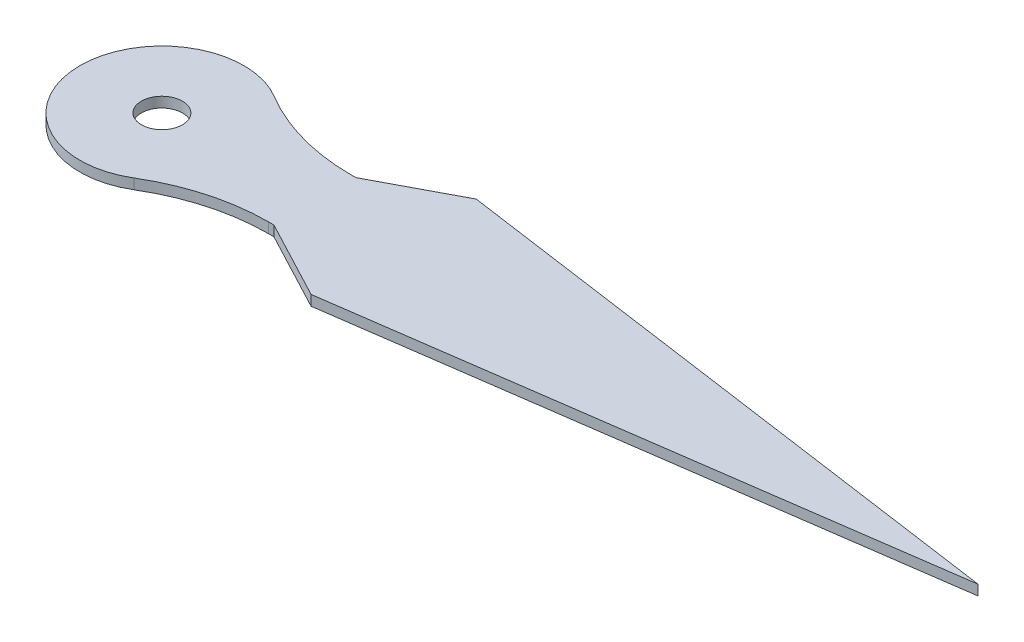
ISO-10303-21;
HEADER;
FILE_DESCRIPTION(('STEP AP214'),'2;1');
FILE_NAME('part.step','',(''),(''),'','','');
FILE_SCHEMA(('AUTOMOTIVE_DESIGN { 1 0 10303 214 1 1 1 1 }'));
ENDSEC;
DATA;
#1=APPLICATION_CONTEXT('core data for automotive mechanical design processes');
#2=APPLICATION_PROTOCOL_DEFINITION('international standard','automotive_design',2000,#1);
#3=PRODUCT_CONTEXT('',#1,'mechanical');
#4=PRODUCT('Part','Part','',(#3));
#5=PRODUCT_RELATED_PRODUCT_CATEGORY('part','',(#4));
#6=PRODUCT_DEFINITION_FORMATION('','',#4);
#7=PRODUCT_DEFINITION_CONTEXT('part definition',#1,'design');
#8=PRODUCT_DEFINITION('design','',#6,#7);
#9=PRODUCT_DEFINITION_SHAPE('','',#8);
#10=(LENGTH_UNIT() NAMED_UNIT(*) SI_UNIT(.MILLI.,.METRE.));
#11=(NAMED_UNIT(*) PLANE_ANGLE_UNIT() SI_UNIT($,.RADIAN.));
#12=(NAMED_UNIT(*) SI_UNIT($,.STERADIAN.) SOLID_ANGLE_UNIT());
#13=UNCERTAINTY_MEASURE_WITH_UNIT(LENGTH_MEASURE(1.E-05),#10,'distance_accuracy_value','');
#14=(GEOMETRIC_REPRESENTATION_CONTEXT(3) GLOBAL_UNCERTAINTY_ASSIGNED_CONTEXT((#13)) GLOBAL_UNIT_ASSIGNED_CONTEXT((#10,
#11,#12)) REPRESENTATION_CONTEXT('',''));
#15=CARTESIAN_POINT('',(0.,0.,0.));
#16=DIRECTION('',(0.,0.,1.));
#17=DIRECTION('',(1.,0.,0.));
#18=AXIS2_PLACEMENT_3D('',#15,#16,#17);
#19=CARTESIAN_POINT('',(0.,0.5,-2.00000000000001));
#20=DIRECTION('',(0.,0.,-1.));
#21=DIRECTION('',(-1.,0.,0.));
#22=AXIS2_PLACEMENT_3D('',#19,#20,#21);
#23=PLANE('',#22);
#24=DIRECTION('',(1.,0.,0.));
#25=VECTOR('',#24,1.);
#26=CARTESIAN_POINT('',(0.,0.,-2.00000000000001));
#27=LINE('',#26,#25);
#28=CARTESIAN_POINT('',(7.21110255092797,0.,-2.));
#29=VERTEX_POINT('',#28);
#30=CARTESIAN_POINT('',(7.46410161513775,0.,-2.));
#31=VERTEX_POINT('',#30);
#32=EDGE_CURVE('E138',#29,#31,#27,.T.);
#33=ORIENTED_EDGE('',*,*,#32,.F.);
#34=DIRECTION('',(0.,-1.,0.));
#35=VECTOR('',#34,1.);
#36=CARTESIAN_POINT('',(7.21110255092797,0.5,-2.));
#37=LINE('',#36,#35);
#38=CARTESIAN_POINT('',(7.21110255092797,0.5,-2.));
#39=VERTEX_POINT('',#38);
#40=EDGE_CURVE('E168',#29,#39,#37,.F.);
#41=ORIENTED_EDGE('',*,*,#40,.T.);
#42=DIRECTION('',(1.,0.,0.));
#43=VECTOR('',#42,1.);
#44=CARTESIAN_POINT('',(0.,0.5,-2.00000000000001));
#45=LINE('',#44,#43);
#46=CARTESIAN_POINT('',(7.46410161513775,0.5,-2.));
#47=VERTEX_POINT('',#46);
#48=EDGE_CURVE('E156',#39,#47,#45,.T.);
#49=ORIENTED_EDGE('',*,*,#48,.T.);
#50=DIRECTION('',(0.,-1.,0.));
#51=VECTOR('',#50,1.);
#52=CARTESIAN_POINT('',(7.46410161513775,0.5,-2.));
#53=LINE('',#52,#51);
#54=EDGE_CURVE('E137',#47,#31,#53,.T.);
#55=ORIENTED_EDGE('',*,*,#54,.T.);
#56=EDGE_LOOP('',(#33,#41,#49,#55));
#57=FACE_BOUND('',#56,.T.);
#58=ADVANCED_FACE('F36',(#57),#23,.T.);
#59=CARTESIAN_POINT('',(0.,0.5,0.));
#60=DIRECTION('',(0.,-1.,0.));
#61=DIRECTION('',(0.,0.,-1.));
#62=AXIS2_PLACEMENT_3D('',#59,#60,#61);
#63=CYLINDRICAL_SURFACE('',#62,4.);
#64=CARTESIAN_POINT('',(0.,0.5,0.));
#65=DIRECTION('',(0.,1.,0.));
#66=DIRECTION('',(0.,0.,1.));
#67=AXIS2_PLACEMENT_3D('',#64,#65,#66);
#68=CIRCLE('',#67,4.);
#69=CARTESIAN_POINT('',(2.06031501455085,0.5,-3.42857142857143));
#70=VERTEX_POINT('',#69);
#71=CARTESIAN_POINT('',(2.06031501455085,0.5,3.42857142857143));
#72=VERTEX_POINT('',#71);
#73=EDGE_CURVE('E111',#70,#72,#68,.T.);
#74=ORIENTED_EDGE('',*,*,#73,.F.);
#75=DIRECTION('',(0.,-1.,0.));
#76=VECTOR('',#75,1.);
#77=CARTESIAN_POINT('',(2.06031501455085,0.5,-3.42857142857143));
#78=LINE('',#77,#76);
#79=CARTESIAN_POINT('',(2.06031501455085,0.,-3.42857142857143));
#80=VERTEX_POINT('',#79);
#81=EDGE_CURVE('E165',#70,#80,#78,.T.);
#82=ORIENTED_EDGE('',*,*,#81,.T.);
#83=CARTESIAN_POINT('',(0.,0.,0.));
#84=DIRECTION('',(0.,1.,0.));
#85=DIRECTION('',(0.,0.,1.));
#86=AXIS2_PLACEMENT_3D('',#83,#84,#85);
#87=CIRCLE('',#86,4.);
#88=CARTESIAN_POINT('',(2.06031501455085,0.,3.42857142857143));
#89=VERTEX_POINT('',#88);
#90=EDGE_CURVE('E140',#80,#89,#87,.T.);
#91=ORIENTED_EDGE('',*,*,#90,.T.);
#92=DIRECTION('',(0.,-1.,0.));
#93=VECTOR('',#92,1.);
#94=CARTESIAN_POINT('',(2.06031501455085,0.5,3.42857142857143));
#95=LINE('',#94,#93);
#96=EDGE_CURVE('E120',#89,#72,#95,.F.);
#97=ORIENTED_EDGE('',*,*,#96,.T.);
#98=EDGE_LOOP('',(#74,#82,#91,#97));
#99=FACE_BOUND('',#98,.T.);
#100=ADVANCED_FACE('F180',(#99),#63,.T.);
#101=CARTESIAN_POINT('',(0.,0.5,2.00000000000001));
#102=DIRECTION('',(0.,0.,-1.));
#103=DIRECTION('',(-1.,0.,0.));
#104=AXIS2_PLACEMENT_3D('',#101,#102,#103);
#105=PLANE('',#104);
#106=DIRECTION('',(1.,0.,0.));
#107=VECTOR('',#106,1.);
#108=CARTESIAN_POINT('',(0.,0.5,2.00000000000001));
#109=LINE('',#108,#107);
#110=CARTESIAN_POINT('',(7.21110255092797,0.5,2.));
#111=VERTEX_POINT('',#110);
#112=CARTESIAN_POINT('',(7.46410161513775,0.5,2.00000000000001));
#113=VERTEX_POINT('',#112);
#114=EDGE_CURVE('E103',#111,#113,#109,.T.);
#115=ORIENTED_EDGE('',*,*,#114,.F.);
#116=DIRECTION('',(0.,1.,0.));
#117=VECTOR('',#116,1.);
#118=CARTESIAN_POINT('',(7.21110255092797,0.,2.));
#119=LINE('',#118,#117);
#120=CARTESIAN_POINT('',(7.21110255092797,0.,2.));
#121=VERTEX_POINT('',#120);
#122=EDGE_CURVE('E170',#111,#121,#119,.F.);
#123=ORIENTED_EDGE('',*,*,#122,.T.);
#124=DIRECTION('',(1.,0.,0.));
#125=VECTOR('',#124,1.);
#126=CARTESIAN_POINT('',(0.,0.,2.00000000000001));
#127=LINE('',#126,#125);
#128=CARTESIAN_POINT('',(7.46410161513775,0.,2.00000000000001));
#129=VERTEX_POINT('',#128);
#130=EDGE_CURVE('E117',#121,#129,#127,.T.);
#131=ORIENTED_EDGE('',*,*,#130,.T.);
#132=DIRECTION('',(0.,-1.,0.));
#133=VECTOR('',#132,1.);
#134=CARTESIAN_POINT('',(7.46410161513775,0.5,2.00000000000001));
#135=LINE('',#134,#133);
#136=EDGE_CURVE('E114',#113,#129,#135,.T.);
#137=ORIENTED_EDGE('',*,*,#136,.F.);
#138=EDGE_LOOP('',(#115,#123,#131,#137));
#139=FACE_BOUND('',#138,.T.);
#140=ADVANCED_FACE('F115',(#139),#105,.F.);
#141=CARTESIAN_POINT('',(0.801892589521018,0.5,-1.51840744270702));
#142=DIRECTION('',(0.46699130377851,0.,-0.884261908144441));
#143=DIRECTION('',(-0.884261908144441,0.,-0.46699130377851));
#144=AXIS2_PLACEMENT_3D('',#141,#142,#143);
#145=PLANE('',#144);
#146=DIRECTION('',(0.884261908144441,0.,0.46699130377851));
#147=VECTOR('',#146,1.);
#148=CARTESIAN_POINT('',(0.801892589521018,0.,-1.51840744270702));
#149=LINE('',#148,#147);
#150=CARTESIAN_POINT('',(11.302617333086,0.,4.02717480328935));
#151=VERTEX_POINT('',#150);
#152=EDGE_CURVE('E145',#129,#151,#149,.T.);
#153=ORIENTED_EDGE('',*,*,#152,.T.);
#154=DIRECTION('',(0.,-1.,0.));
#155=VECTOR('',#154,1.);
#156=CARTESIAN_POINT('',(11.302617333086,0.5,4.02717480328935));
#157=LINE('',#156,#155);
#158=CARTESIAN_POINT('',(11.302617333086,0.5,4.02717480328935));
#159=VERTEX_POINT('',#158);
#160=EDGE_CURVE('E121',#159,#151,#157,.T.);
#161=ORIENTED_EDGE('',*,*,#160,.F.);
#162=DIRECTION('',(0.884261908144441,0.,0.46699130377851));
#163=VECTOR('',#162,1.);
#164=CARTESIAN_POINT('',(0.801892589521018,0.5,-1.51840744270702));
#165=LINE('',#164,#163);
#166=EDGE_CURVE('E108',#113,#159,#165,.T.);
#167=ORIENTED_EDGE('',*,*,#166,.F.);
#168=ORIENTED_EDGE('',*,*,#136,.T.);
#169=EDGE_LOOP('',(#153,#161,#167,#168));
#170=FACE_BOUND('',#169,.T.);
#171=ADVANCED_FACE('F123',(#170),#145,.F.);
#172=CARTESIAN_POINT('',(0.779206921046703,0.5,5.51422283683899));
#173=DIRECTION('',(-0.139918516531435,0.,-0.990163021290758));
#174=DIRECTION('',(-0.990163021290758,0.,0.139918516531435));
#175=AXIS2_PLACEMENT_3D('',#172,#173,#174);
#176=PLANE('',#175);
#177=DIRECTION('',(0.990163021290758,0.,-0.139918516531435));
#178=VECTOR('',#177,1.);
#179=CARTESIAN_POINT('',(0.779206921046703,0.,5.51422283683899));
#180=LINE('',#179,#178);
#181=CARTESIAN_POINT('',(39.8017729083606,0.,0.));
#182=VERTEX_POINT('',#181);
#183=EDGE_CURVE('E147',#151,#182,#180,.T.);
#184=ORIENTED_EDGE('',*,*,#183,.T.);
#185=DIRECTION('',(0.,-1.,0.));
#186=VECTOR('',#185,1.);
#187=CARTESIAN_POINT('',(39.8017729083606,0.5,0.));
#188=LINE('',#187,#186);
#189=CARTESIAN_POINT('',(39.8017729083606,0.5,0.));
#190=VERTEX_POINT('',#189);
#191=EDGE_CURVE('E161',#190,#182,#188,.T.);
#192=ORIENTED_EDGE('',*,*,#191,.F.);
#193=DIRECTION('',(0.990163021290758,0.,-0.139918516531435));
#194=VECTOR('',#193,1.);
#195=CARTESIAN_POINT('',(0.779206921046703,0.5,5.51422283683899));
#196=LINE('',#195,#194);
#197=EDGE_CURVE('E126',#159,#190,#196,.T.);
#198=ORIENTED_EDGE('',*,*,#197,.F.);
#199=ORIENTED_EDGE('',*,*,#160,.T.);
#200=EDGE_LOOP('',(#184,#192,#198,#199));
#201=FACE_BOUND('',#200,.T.);
#202=ADVANCED_FACE('F202',(#201),#176,.F.);
#203=CARTESIAN_POINT('',(0.779206921046703,0.5,-5.51422283683899));
#204=DIRECTION('',(0.139918516531435,0.,-0.990163021290758));
#205=DIRECTION('',(-0.990163021290758,0.,-0.139918516531435));
#206=AXIS2_PLACEMENT_3D('',#203,#204,#205);
#207=PLANE('',#206);
#208=DIRECTION('',(0.990163021290758,0.,0.139918516531435));
#209=VECTOR('',#208,1.);
#210=CARTESIAN_POINT('',(0.779206921046703,0.,-5.51422283683899));
#211=LINE('',#210,#209);
#212=CARTESIAN_POINT('',(11.302617333086,0.,-4.02717480328935));
#213=VERTEX_POINT('',#212);
#214=EDGE_CURVE('E150',#213,#182,#211,.T.);
#215=ORIENTED_EDGE('',*,*,#214,.F.);
#216=DIRECTION('',(0.,-1.,0.));
#217=VECTOR('',#216,1.);
#218=CARTESIAN_POINT('',(11.302617333086,0.5,-4.02717480328935));
#219=LINE('',#218,#217);
#220=CARTESIAN_POINT('',(11.302617333086,0.5,-4.02717480328935));
#221=VERTEX_POINT('',#220);
#222=EDGE_CURVE('E159',#221,#213,#219,.T.);
#223=ORIENTED_EDGE('',*,*,#222,.F.);
#224=DIRECTION('',(0.990163021290758,0.,0.139918516531435));
#225=VECTOR('',#224,1.);
#226=CARTESIAN_POINT('',(0.779206921046703,0.5,-5.51422283683899));
#227=LINE('',#226,#225);
#228=EDGE_CURVE('E128',#221,#190,#227,.T.);
#229=ORIENTED_EDGE('',*,*,#228,.T.);
#230=ORIENTED_EDGE('',*,*,#191,.T.);
#231=EDGE_LOOP('',(#215,#223,#229,#230));
#232=FACE_BOUND('',#231,.T.);
#233=ADVANCED_FACE('F205',(#232),#207,.T.);
#234=CARTESIAN_POINT('',(0.801892589521018,0.5,1.51840744270702));
#235=DIRECTION('',(-0.46699130377851,0.,-0.884261908144441));
#236=DIRECTION('',(-0.884261908144441,0.,0.46699130377851));
#237=AXIS2_PLACEMENT_3D('',#234,#235,#236);
#238=PLANE('',#237);
#239=DIRECTION('',(0.884261908144441,0.,-0.46699130377851));
#240=VECTOR('',#239,1.);
#241=CARTESIAN_POINT('',(0.801892589521018,0.,1.51840744270702));
#242=LINE('',#241,#240);
#243=EDGE_CURVE('E153',#31,#213,#242,.T.);
#244=ORIENTED_EDGE('',*,*,#243,.F.);
#245=ORIENTED_EDGE('',*,*,#54,.F.);
#246=DIRECTION('',(0.884261908144441,0.,-0.46699130377851));
#247=VECTOR('',#246,1.);
#248=CARTESIAN_POINT('',(0.801892589521018,0.5,1.51840744270702));
#249=LINE('',#248,#247);
#250=EDGE_CURVE('E134',#47,#221,#249,.T.);
#251=ORIENTED_EDGE('',*,*,#250,.T.);
#252=ORIENTED_EDGE('',*,*,#222,.T.);
#253=EDGE_LOOP('',(#244,#245,#251,#252));
#254=FACE_BOUND('',#253,.T.);
#255=ADVANCED_FACE('F209',(#254),#238,.T.);
#256=CARTESIAN_POINT('',(0.,0.5,0.));
#257=DIRECTION('',(0.,1.,0.));
#258=DIRECTION('',(0.,0.,1.));
#259=AXIS2_PLACEMENT_3D('',#256,#257,#258);
#260=PLANE('',#259);
#261=CARTESIAN_POINT('',(0.,0.5,0.));
#262=DIRECTION('',(0.,1.,0.));
#263=DIRECTION('',(0.,0.,1.));
#264=AXIS2_PLACEMENT_3D('',#261,#262,#263);
#265=CIRCLE('',#264,1.);
#266=CARTESIAN_POINT('',(0.,0.5,1.));
#267=VERTEX_POINT('',#266);
#268=EDGE_CURVE('E229',#267,#267,#265,.T.);
#269=ORIENTED_EDGE('',*,*,#268,.F.);
#270=EDGE_LOOP('',(#269));
#271=FACE_BOUND('',#270,.T.);
#272=ORIENTED_EDGE('',*,*,#48,.F.);
#273=CARTESIAN_POINT('',(7.21110255092797,0.5,-12.));
#274=DIRECTION('',(0.,1.,0.));
#275=DIRECTION('',(0.,0.,1.));
#276=AXIS2_PLACEMENT_3D('',#273,#274,#275);
#277=CIRCLE('',#276,10.);
#278=EDGE_CURVE('E174',#39,#70,#277,.F.);
#279=ORIENTED_EDGE('',*,*,#278,.T.);
#280=ORIENTED_EDGE('',*,*,#73,.T.);
#281=CARTESIAN_POINT('',(7.21110255092797,0.5,12.));
#282=DIRECTION('',(0.,1.,0.));
#283=DIRECTION('',(0.,0.,1.));
#284=AXIS2_PLACEMENT_3D('',#281,#282,#283);
#285=CIRCLE('',#284,10.);
#286=EDGE_CURVE('E11',#72,#111,#285,.F.);
#287=ORIENTED_EDGE('',*,*,#286,.T.);
#288=ORIENTED_EDGE('',*,*,#114,.T.);
#289=ORIENTED_EDGE('',*,*,#166,.T.);
#290=ORIENTED_EDGE('',*,*,#197,.T.);
#291=ORIENTED_EDGE('',*,*,#228,.F.);
#292=ORIENTED_EDGE('',*,*,#250,.F.);
#293=EDGE_LOOP('',(#272,#279,#280,#287,#288,#289,#290,#291,#292));
#294=FACE_BOUND('',#293,.T.);
#295=ADVANCED_FACE('F106',(#271,#294),#260,.T.);
#296=CARTESIAN_POINT('',(0.,0.,0.));
#297=DIRECTION('',(0.,1.,0.));
#298=DIRECTION('',(0.,0.,1.));
#299=AXIS2_PLACEMENT_3D('',#296,#297,#298);
#300=PLANE('',#299);
#301=CARTESIAN_POINT('',(0.,0.,0.));
#302=DIRECTION('',(0.,1.,0.));
#303=DIRECTION('',(0.,0.,1.));
#304=AXIS2_PLACEMENT_3D('',#301,#302,#303);
#305=CIRCLE('',#304,1.);
#306=CARTESIAN_POINT('',(0.,0.,1.));
#307=VERTEX_POINT('',#306);
#308=EDGE_CURVE('E141',#307,#307,#305,.T.);
#309=ORIENTED_EDGE('',*,*,#308,.T.);
#310=EDGE_LOOP('',(#309));
#311=FACE_BOUND('',#310,.T.);
#312=ORIENTED_EDGE('',*,*,#90,.F.);
#313=CARTESIAN_POINT('',(7.21110255092797,0.,-12.));
#314=DIRECTION('',(0.,1.,0.));
#315=DIRECTION('',(0.,0.,1.));
#316=AXIS2_PLACEMENT_3D('',#313,#314,#315);
#317=CIRCLE('',#316,10.);
#318=EDGE_CURVE('E172',#80,#29,#317,.T.);
#319=ORIENTED_EDGE('',*,*,#318,.T.);
#320=ORIENTED_EDGE('',*,*,#32,.T.);
#321=ORIENTED_EDGE('',*,*,#243,.T.);
#322=ORIENTED_EDGE('',*,*,#214,.T.);
#323=ORIENTED_EDGE('',*,*,#183,.F.);
#324=ORIENTED_EDGE('',*,*,#152,.F.);
#325=ORIENTED_EDGE('',*,*,#130,.F.);
#326=CARTESIAN_POINT('',(7.21110255092797,0.,12.));
#327=DIRECTION('',(0.,1.,0.));
#328=DIRECTION('',(0.,0.,1.));
#329=AXIS2_PLACEMENT_3D('',#326,#327,#328);
#330=CIRCLE('',#329,10.);
#331=EDGE_CURVE('E44',#121,#89,#330,.T.);
#332=ORIENTED_EDGE('',*,*,#331,.T.);
#333=EDGE_LOOP('',(#312,#319,#320,#321,#322,#323,#324,#325,#332));
#334=FACE_BOUND('',#333,.T.);
#335=ADVANCED_FACE('F177',(#311,#334),#300,.F.);
#336=CARTESIAN_POINT('',(0.,0.,0.));
#337=DIRECTION('',(0.,1.,0.));
#338=DIRECTION('',(0.,0.,1.));
#339=AXIS2_PLACEMENT_3D('',#336,#337,#338);
#340=CYLINDRICAL_SURFACE('',#339,1.);
#341=ORIENTED_EDGE('',*,*,#308,.F.);
#342=EDGE_LOOP('',(#341));
#343=FACE_BOUND('',#342,.T.);
#344=ORIENTED_EDGE('',*,*,#268,.T.);
#345=EDGE_LOOP('',(#344));
#346=FACE_BOUND('',#345,.T.);
#347=ADVANCED_FACE('F187',(#343,#346),#340,.F.);
#348=CARTESIAN_POINT('',(7.21110255092797,0.5,-12.));
#349=DIRECTION('',(0.,-1.,0.));
#350=DIRECTION('',(0.,0.,-1.));
#351=AXIS2_PLACEMENT_3D('',#348,#349,#350);
#352=CYLINDRICAL_SURFACE('',#351,10.);
#353=ORIENTED_EDGE('',*,*,#278,.F.);
#354=ORIENTED_EDGE('',*,*,#40,.F.);
#355=ORIENTED_EDGE('',*,*,#318,.F.);
#356=ORIENTED_EDGE('',*,*,#81,.F.);
#357=EDGE_LOOP('',(#353,#354,#355,#356));
#358=FACE_BOUND('',#357,.T.);
#359=ADVANCED_FACE('F183',(#358),#352,.F.);
#360=CARTESIAN_POINT('',(7.21110255092797,0.5,12.));
#361=DIRECTION('',(0.,-1.,0.));
#362=DIRECTION('',(0.,0.,-1.));
#363=AXIS2_PLACEMENT_3D('',#360,#361,#362);
#364=CYLINDRICAL_SURFACE('',#363,10.);
#365=ORIENTED_EDGE('',*,*,#286,.F.);
#366=ORIENTED_EDGE('',*,*,#96,.F.);
#367=ORIENTED_EDGE('',*,*,#331,.F.);
#368=ORIENTED_EDGE('',*,*,#122,.F.);
#369=EDGE_LOOP('',(#365,#366,#367,#368));
#370=FACE_BOUND('',#369,.T.);
#371=ADVANCED_FACE('F38',(#370),#364,.F.);
#372=CLOSED_SHELL('',(#58,#100,#140,#171,#202,#233,#255,#295,#335,#347,#359,#371));
#373=MANIFOLD_SOLID_BREP('B2',#372);
#374=ADVANCED_BREP_SHAPE_REPRESENTATION('',(#18,#373),#14);
#375=SHAPE_DEFINITION_REPRESENTATION(#9,#374);
ENDSEC;
END-ISO-10303-21;
